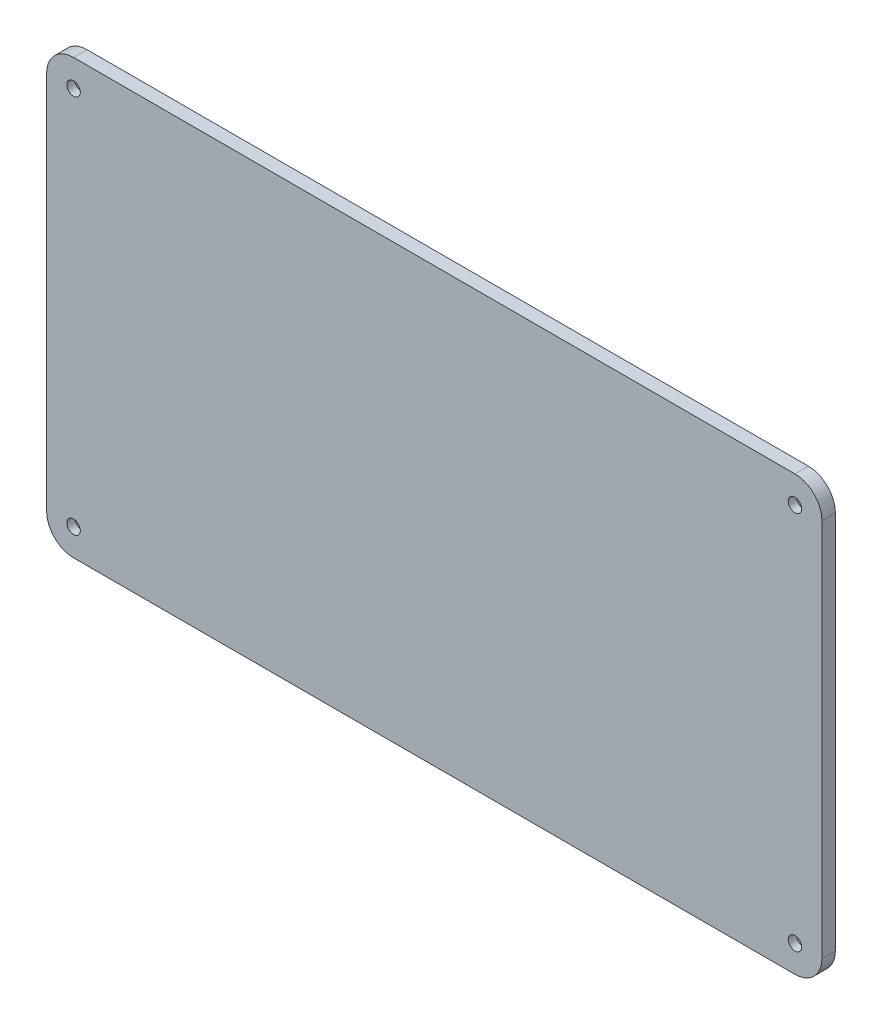
ISO-10303-21;
HEADER;
FILE_DESCRIPTION(('STEP AP214'),'2;1');
FILE_NAME('part.step','',(''),(''),'','','');
FILE_SCHEMA(('AUTOMOTIVE_DESIGN { 1 0 10303 214 1 1 1 1 }'));
ENDSEC;
DATA;
#1=APPLICATION_CONTEXT('core data for automotive mechanical design processes');
#2=APPLICATION_PROTOCOL_DEFINITION('international standard','automotive_design',2000,#1);
#3=PRODUCT_CONTEXT('',#1,'mechanical');
#4=PRODUCT('Part','Part','',(#3));
#5=PRODUCT_RELATED_PRODUCT_CATEGORY('part','',(#4));
#6=PRODUCT_DEFINITION_FORMATION('','',#4);
#7=PRODUCT_DEFINITION_CONTEXT('part definition',#1,'design');
#8=PRODUCT_DEFINITION('design','',#6,#7);
#9=PRODUCT_DEFINITION_SHAPE('','',#8);
#10=(LENGTH_UNIT() NAMED_UNIT(*) SI_UNIT(.MILLI.,.METRE.));
#11=(NAMED_UNIT(*) PLANE_ANGLE_UNIT() SI_UNIT($,.RADIAN.));
#12=(NAMED_UNIT(*) SI_UNIT($,.STERADIAN.) SOLID_ANGLE_UNIT());
#13=UNCERTAINTY_MEASURE_WITH_UNIT(LENGTH_MEASURE(1.E-05),#10,'distance_accuracy_value','');
#14=(GEOMETRIC_REPRESENTATION_CONTEXT(3) GLOBAL_UNCERTAINTY_ASSIGNED_CONTEXT((#13)) GLOBAL_UNIT_ASSIGNED_CONTEXT((#10,
#11,#12)) REPRESENTATION_CONTEXT('',''));
#15=CARTESIAN_POINT('',(0.,0.,0.));
#16=DIRECTION('',(0.,0.,1.));
#17=DIRECTION('',(1.,0.,0.));
#18=AXIS2_PLACEMENT_3D('',#15,#16,#17);
#19=CARTESIAN_POINT('',(10.,151.,0.));
#20=DIRECTION('',(0.,0.,1.));
#21=DIRECTION('',(1.,0.,0.));
#22=AXIS2_PLACEMENT_3D('',#19,#20,#21);
#23=CYLINDRICAL_SURFACE('',#22,0.799999999999999);
#24=CARTESIAN_POINT('',(10.,151.,0.));
#25=DIRECTION('',(0.,0.,1.));
#26=DIRECTION('',(1.,0.,0.));
#27=AXIS2_PLACEMENT_3D('',#24,#25,#26);
#28=CIRCLE('',#27,0.799999999999999);
#29=CARTESIAN_POINT('',(10.8,151.,0.));
#30=VERTEX_POINT('',#29);
#31=EDGE_CURVE('E153',#30,#30,#28,.T.);
#32=ORIENTED_EDGE('',*,*,#31,.F.);
#33=EDGE_LOOP('',(#32));
#34=FACE_BOUND('',#33,.T.);
#35=CARTESIAN_POINT('',(10.,151.,2.));
#36=DIRECTION('',(0.,0.,1.));
#37=DIRECTION('',(1.,0.,0.));
#38=AXIS2_PLACEMENT_3D('',#35,#36,#37);
#39=CIRCLE('',#38,0.799999999999999);
#40=CARTESIAN_POINT('',(10.8,151.,2.));
#41=VERTEX_POINT('',#40);
#42=EDGE_CURVE('E48',#41,#41,#39,.F.);
#43=ORIENTED_EDGE('',*,*,#42,.F.);
#44=EDGE_LOOP('',(#43));
#45=FACE_BOUND('',#44,.T.);
#46=ADVANCED_FACE('F44',(#34,#45),#23,.F.);
#47=CARTESIAN_POINT('',(278.,10.,0.));
#48=DIRECTION('',(0.,0.,1.));
#49=DIRECTION('',(1.,0.,0.));
#50=AXIS2_PLACEMENT_3D('',#47,#48,#49);
#51=CYLINDRICAL_SURFACE('',#50,0.800000000000011);
#52=CARTESIAN_POINT('',(278.,10.,0.));
#53=DIRECTION('',(0.,0.,1.));
#54=DIRECTION('',(1.,0.,0.));
#55=AXIS2_PLACEMENT_3D('',#52,#53,#54);
#56=CIRCLE('',#55,0.800000000000011);
#57=CARTESIAN_POINT('',(278.8,10.,0.));
#58=VERTEX_POINT('',#57);
#59=EDGE_CURVE('E204',#58,#58,#56,.T.);
#60=ORIENTED_EDGE('',*,*,#59,.F.);
#61=EDGE_LOOP('',(#60));
#62=FACE_BOUND('',#61,.T.);
#63=CARTESIAN_POINT('',(278.,10.,2.));
#64=DIRECTION('',(0.,0.,1.));
#65=DIRECTION('',(1.,0.,0.));
#66=AXIS2_PLACEMENT_3D('',#63,#64,#65);
#67=CIRCLE('',#66,0.800000000000011);
#68=CARTESIAN_POINT('',(278.8,10.,2.));
#69=VERTEX_POINT('',#68);
#70=EDGE_CURVE('E197',#69,#69,#67,.F.);
#71=ORIENTED_EDGE('',*,*,#70,.F.);
#72=EDGE_LOOP('',(#71));
#73=FACE_BOUND('',#72,.T.);
#74=ADVANCED_FACE('F266',(#62,#73),#51,.F.);
#75=CARTESIAN_POINT('',(10.,10.,0.));
#76=DIRECTION('',(0.,0.,1.));
#77=DIRECTION('',(1.,0.,0.));
#78=AXIS2_PLACEMENT_3D('',#75,#76,#77);
#79=CYLINDRICAL_SURFACE('',#78,0.800000000000001);
#80=CARTESIAN_POINT('',(10.,10.,0.));
#81=DIRECTION('',(0.,0.,1.));
#82=DIRECTION('',(1.,0.,0.));
#83=AXIS2_PLACEMENT_3D('',#80,#81,#82);
#84=CIRCLE('',#83,0.800000000000001);
#85=CARTESIAN_POINT('',(10.8,10.,0.));
#86=VERTEX_POINT('',#85);
#87=EDGE_CURVE('E209',#86,#86,#84,.T.);
#88=ORIENTED_EDGE('',*,*,#87,.F.);
#89=EDGE_LOOP('',(#88));
#90=FACE_BOUND('',#89,.T.);
#91=CARTESIAN_POINT('',(10.,10.,2.));
#92=DIRECTION('',(0.,0.,1.));
#93=DIRECTION('',(1.,0.,0.));
#94=AXIS2_PLACEMENT_3D('',#91,#92,#93);
#95=CIRCLE('',#94,0.800000000000001);
#96=CARTESIAN_POINT('',(10.8,10.,2.));
#97=VERTEX_POINT('',#96);
#98=EDGE_CURVE('E193',#97,#97,#95,.F.);
#99=ORIENTED_EDGE('',*,*,#98,.F.);
#100=EDGE_LOOP('',(#99));
#101=FACE_BOUND('',#100,.T.);
#102=ADVANCED_FACE('F272',(#90,#101),#79,.F.);
#103=CARTESIAN_POINT('',(278.,151.,0.));
#104=DIRECTION('',(0.,0.,1.));
#105=DIRECTION('',(1.,0.,0.));
#106=AXIS2_PLACEMENT_3D('',#103,#104,#105);
#107=CYLINDRICAL_SURFACE('',#106,0.800000000000008);
#108=CARTESIAN_POINT('',(278.,151.,0.));
#109=DIRECTION('',(0.,0.,1.));
#110=DIRECTION('',(1.,0.,0.));
#111=AXIS2_PLACEMENT_3D('',#108,#109,#110);
#112=CIRCLE('',#111,0.800000000000008);
#113=CARTESIAN_POINT('',(278.8,151.,0.));
#114=VERTEX_POINT('',#113);
#115=EDGE_CURVE('E215',#114,#114,#112,.T.);
#116=ORIENTED_EDGE('',*,*,#115,.F.);
#117=EDGE_LOOP('',(#116));
#118=FACE_BOUND('',#117,.T.);
#119=CARTESIAN_POINT('',(278.,151.,2.));
#120=DIRECTION('',(0.,0.,1.));
#121=DIRECTION('',(1.,0.,0.));
#122=AXIS2_PLACEMENT_3D('',#119,#120,#121);
#123=CIRCLE('',#122,0.800000000000008);
#124=CARTESIAN_POINT('',(278.8,151.,2.));
#125=VERTEX_POINT('',#124);
#126=EDGE_CURVE('E189',#125,#125,#123,.F.);
#127=ORIENTED_EDGE('',*,*,#126,.F.);
#128=EDGE_LOOP('',(#127));
#129=FACE_BOUND('',#128,.T.);
#130=ADVANCED_FACE('F295',(#118,#129),#107,.F.);
#131=CARTESIAN_POINT('',(278.,151.,5.));
#132=DIRECTION('',(0.,0.,-1.));
#133=DIRECTION('',(-1.,0.,0.));
#134=AXIS2_PLACEMENT_3D('',#131,#132,#133);
#135=CYLINDRICAL_SURFACE('',#134,10.);
#136=CARTESIAN_POINT('',(278.,151.,0.));
#137=DIRECTION('',(0.,0.,1.));
#138=DIRECTION('',(-1.,0.,0.));
#139=AXIS2_PLACEMENT_3D('',#136,#137,#138);
#140=CIRCLE('',#139,10.);
#141=CARTESIAN_POINT('',(288.,151.,0.));
#142=VERTEX_POINT('',#141);
#143=CARTESIAN_POINT('',(278.,161.,0.));
#144=VERTEX_POINT('',#143);
#145=EDGE_CURVE('E148',#142,#144,#140,.T.);
#146=ORIENTED_EDGE('',*,*,#145,.T.);
#147=DIRECTION('',(0.,0.,-1.));
#148=VECTOR('',#147,1.);
#149=CARTESIAN_POINT('',(278.,161.,5.));
#150=LINE('',#149,#148);
#151=CARTESIAN_POINT('',(278.,161.,5.));
#152=VERTEX_POINT('',#151);
#153=EDGE_CURVE('E11',#152,#144,#150,.T.);
#154=ORIENTED_EDGE('',*,*,#153,.F.);
#155=CARTESIAN_POINT('',(278.,151.,5.));
#156=DIRECTION('',(0.,0.,1.));
#157=DIRECTION('',(-1.,0.,0.));
#158=AXIS2_PLACEMENT_3D('',#155,#156,#157);
#159=CIRCLE('',#158,10.);
#160=CARTESIAN_POINT('',(288.,151.,5.));
#161=VERTEX_POINT('',#160);
#162=EDGE_CURVE('E171',#161,#152,#159,.T.);
#163=ORIENTED_EDGE('',*,*,#162,.F.);
#164=DIRECTION('',(0.,0.,-1.));
#165=VECTOR('',#164,1.);
#166=CARTESIAN_POINT('',(288.,151.,5.));
#167=LINE('',#166,#165);
#168=EDGE_CURVE('E144',#161,#142,#167,.T.);
#169=ORIENTED_EDGE('',*,*,#168,.T.);
#170=EDGE_LOOP('',(#146,#154,#163,#169));
#171=FACE_BOUND('',#170,.T.);
#172=ADVANCED_FACE('F46',(#171),#135,.T.);
#173=CARTESIAN_POINT('',(10.0000000000001,161.,5.));
#174=DIRECTION('',(0.,-1.,0.));
#175=DIRECTION('',(0.,0.,-1.));
#176=AXIS2_PLACEMENT_3D('',#173,#174,#175);
#177=PLANE('',#176);
#178=DIRECTION('',(-1.,0.,0.));
#179=VECTOR('',#178,1.);
#180=CARTESIAN_POINT('',(10.0000000000001,161.,0.));
#181=LINE('',#180,#179);
#182=CARTESIAN_POINT('',(10.0000000000001,161.,0.));
#183=VERTEX_POINT('',#182);
#184=EDGE_CURVE('E152',#144,#183,#181,.T.);
#185=ORIENTED_EDGE('',*,*,#184,.T.);
#186=DIRECTION('',(0.,0.,-1.));
#187=VECTOR('',#186,1.);
#188=CARTESIAN_POINT('',(10.0000000000001,161.,5.));
#189=LINE('',#188,#187);
#190=CARTESIAN_POINT('',(10.0000000000001,161.,5.));
#191=VERTEX_POINT('',#190);
#192=EDGE_CURVE('E55',#191,#183,#189,.T.);
#193=ORIENTED_EDGE('',*,*,#192,.F.);
#194=DIRECTION('',(-1.,0.,0.));
#195=VECTOR('',#194,1.);
#196=CARTESIAN_POINT('',(10.0000000000001,161.,5.));
#197=LINE('',#196,#195);
#198=EDGE_CURVE('E107',#152,#191,#197,.T.);
#199=ORIENTED_EDGE('',*,*,#198,.F.);
#200=ORIENTED_EDGE('',*,*,#153,.T.);
#201=EDGE_LOOP('',(#185,#193,#199,#200));
#202=FACE_BOUND('',#201,.T.);
#203=ADVANCED_FACE('F333',(#202),#177,.F.);
#204=CARTESIAN_POINT('',(10.,151.,5.));
#205=DIRECTION('',(0.,0.,-1.));
#206=DIRECTION('',(-1.,0.,0.));
#207=AXIS2_PLACEMENT_3D('',#204,#205,#206);
#208=CYLINDRICAL_SURFACE('',#207,10.);
#209=CARTESIAN_POINT('',(10.,151.,0.));
#210=DIRECTION('',(0.,0.,1.));
#211=DIRECTION('',(-1.,0.,0.));
#212=AXIS2_PLACEMENT_3D('',#209,#210,#211);
#213=CIRCLE('',#212,10.);
#214=CARTESIAN_POINT('',(0.,151.,0.));
#215=VERTEX_POINT('',#214);
#216=EDGE_CURVE('E156',#183,#215,#213,.T.);
#217=ORIENTED_EDGE('',*,*,#216,.T.);
#218=DIRECTION('',(0.,0.,-1.));
#219=VECTOR('',#218,1.);
#220=CARTESIAN_POINT('',(0.,151.,5.));
#221=LINE('',#220,#219);
#222=CARTESIAN_POINT('',(0.,151.,5.));
#223=VERTEX_POINT('',#222);
#224=EDGE_CURVE('E182',#223,#215,#221,.T.);
#225=ORIENTED_EDGE('',*,*,#224,.F.);
#226=CARTESIAN_POINT('',(10.,151.,5.));
#227=DIRECTION('',(0.,0.,1.));
#228=DIRECTION('',(-1.,0.,0.));
#229=AXIS2_PLACEMENT_3D('',#226,#227,#228);
#230=CIRCLE('',#229,10.);
#231=EDGE_CURVE('E231',#191,#223,#230,.T.);
#232=ORIENTED_EDGE('',*,*,#231,.F.);
#233=ORIENTED_EDGE('',*,*,#192,.T.);
#234=EDGE_LOOP('',(#217,#225,#232,#233));
#235=FACE_BOUND('',#234,.T.);
#236=ADVANCED_FACE('F340',(#235),#208,.T.);
#237=CARTESIAN_POINT('',(0.,10.0000000000001,5.));
#238=DIRECTION('',(1.,0.,0.));
#239=DIRECTION('',(0.,0.,-1.));
#240=AXIS2_PLACEMENT_3D('',#237,#238,#239);
#241=PLANE('',#240);
#242=DIRECTION('',(0.,-1.,0.));
#243=VECTOR('',#242,1.);
#244=CARTESIAN_POINT('',(0.,10.0000000000001,0.));
#245=LINE('',#244,#243);
#246=CARTESIAN_POINT('',(0.,10.0000000000001,0.));
#247=VERTEX_POINT('',#246);
#248=EDGE_CURVE('E159',#215,#247,#245,.T.);
#249=ORIENTED_EDGE('',*,*,#248,.T.);
#250=DIRECTION('',(0.,0.,-1.));
#251=VECTOR('',#250,1.);
#252=CARTESIAN_POINT('',(0.,10.0000000000001,5.));
#253=LINE('',#252,#251);
#254=CARTESIAN_POINT('',(0.,10.0000000000001,5.));
#255=VERTEX_POINT('',#254);
#256=EDGE_CURVE('E178',#255,#247,#253,.T.);
#257=ORIENTED_EDGE('',*,*,#256,.F.);
#258=DIRECTION('',(0.,-1.,0.));
#259=VECTOR('',#258,1.);
#260=CARTESIAN_POINT('',(0.,10.0000000000001,5.));
#261=LINE('',#260,#259);
#262=EDGE_CURVE('E234',#223,#255,#261,.T.);
#263=ORIENTED_EDGE('',*,*,#262,.F.);
#264=ORIENTED_EDGE('',*,*,#224,.T.);
#265=EDGE_LOOP('',(#249,#257,#263,#264));
#266=FACE_BOUND('',#265,.T.);
#267=ADVANCED_FACE('F242',(#266),#241,.F.);
#268=CARTESIAN_POINT('',(10.,10.,5.));
#269=DIRECTION('',(0.,0.,-1.));
#270=DIRECTION('',(-1.,0.,0.));
#271=AXIS2_PLACEMENT_3D('',#268,#269,#270);
#272=CYLINDRICAL_SURFACE('',#271,10.);
#273=CARTESIAN_POINT('',(10.,10.,0.));
#274=DIRECTION('',(0.,0.,1.));
#275=DIRECTION('',(-1.,0.,0.));
#276=AXIS2_PLACEMENT_3D('',#273,#274,#275);
#277=CIRCLE('',#276,10.);
#278=CARTESIAN_POINT('',(10.0000000000001,0.,0.));
#279=VERTEX_POINT('',#278);
#280=EDGE_CURVE('E162',#247,#279,#277,.T.);
#281=ORIENTED_EDGE('',*,*,#280,.T.);
#282=DIRECTION('',(0.,0.,-1.));
#283=VECTOR('',#282,1.);
#284=CARTESIAN_POINT('',(10.0000000000001,0.,5.));
#285=LINE('',#284,#283);
#286=CARTESIAN_POINT('',(10.0000000000001,0.,5.));
#287=VERTEX_POINT('',#286);
#288=EDGE_CURVE('E137',#287,#279,#285,.T.);
#289=ORIENTED_EDGE('',*,*,#288,.F.);
#290=CARTESIAN_POINT('',(10.,10.,5.));
#291=DIRECTION('',(0.,0.,1.));
#292=DIRECTION('',(-1.,0.,0.));
#293=AXIS2_PLACEMENT_3D('',#290,#291,#292);
#294=CIRCLE('',#293,10.);
#295=EDGE_CURVE('E126',#255,#287,#294,.T.);
#296=ORIENTED_EDGE('',*,*,#295,.F.);
#297=ORIENTED_EDGE('',*,*,#256,.T.);
#298=EDGE_LOOP('',(#281,#289,#296,#297));
#299=FACE_BOUND('',#298,.T.);
#300=ADVANCED_FACE('F246',(#299),#272,.T.);
#301=CARTESIAN_POINT('',(10.0000000000001,0.,5.));
#302=DIRECTION('',(0.,1.,0.));
#303=DIRECTION('',(0.,0.,1.));
#304=AXIS2_PLACEMENT_3D('',#301,#302,#303);
#305=PLANE('',#304);
#306=DIRECTION('',(1.,0.,0.));
#307=VECTOR('',#306,1.);
#308=CARTESIAN_POINT('',(10.0000000000001,0.,0.));
#309=LINE('',#308,#307);
#310=CARTESIAN_POINT('',(278.,0.,0.));
#311=VERTEX_POINT('',#310);
#312=EDGE_CURVE('E135',#279,#311,#309,.T.);
#313=ORIENTED_EDGE('',*,*,#312,.T.);
#314=DIRECTION('',(0.,0.,-1.));
#315=VECTOR('',#314,1.);
#316=CARTESIAN_POINT('',(278.,0.,5.));
#317=LINE('',#316,#315);
#318=CARTESIAN_POINT('',(278.,0.,5.));
#319=VERTEX_POINT('',#318);
#320=EDGE_CURVE('E132',#319,#311,#317,.T.);
#321=ORIENTED_EDGE('',*,*,#320,.F.);
#322=DIRECTION('',(1.,0.,0.));
#323=VECTOR('',#322,1.);
#324=CARTESIAN_POINT('',(10.0000000000001,0.,5.));
#325=LINE('',#324,#323);
#326=EDGE_CURVE('E120',#287,#319,#325,.T.);
#327=ORIENTED_EDGE('',*,*,#326,.F.);
#328=ORIENTED_EDGE('',*,*,#288,.T.);
#329=EDGE_LOOP('',(#313,#321,#327,#328));
#330=FACE_BOUND('',#329,.T.);
#331=ADVANCED_FACE('F133',(#330),#305,.F.);
#332=CARTESIAN_POINT('',(278.,10.,5.));
#333=DIRECTION('',(0.,0.,-1.));
#334=DIRECTION('',(-1.,0.,0.));
#335=AXIS2_PLACEMENT_3D('',#332,#333,#334);
#336=CYLINDRICAL_SURFACE('',#335,10.);
#337=CARTESIAN_POINT('',(278.,10.,0.));
#338=DIRECTION('',(0.,0.,1.));
#339=DIRECTION('',(1.,0.,0.));
#340=AXIS2_PLACEMENT_3D('',#337,#338,#339);
#341=CIRCLE('',#340,10.);
#342=CARTESIAN_POINT('',(288.,10.,0.));
#343=VERTEX_POINT('',#342);
#344=EDGE_CURVE('E93',#311,#343,#341,.T.);
#345=ORIENTED_EDGE('',*,*,#344,.T.);
#346=DIRECTION('',(0.,0.,-1.));
#347=VECTOR('',#346,1.);
#348=CARTESIAN_POINT('',(288.,10.,5.));
#349=LINE('',#348,#347);
#350=CARTESIAN_POINT('',(288.,10.,5.));
#351=VERTEX_POINT('',#350);
#352=EDGE_CURVE('E138',#351,#343,#349,.T.);
#353=ORIENTED_EDGE('',*,*,#352,.F.);
#354=CARTESIAN_POINT('',(278.,10.,5.));
#355=DIRECTION('',(0.,0.,1.));
#356=DIRECTION('',(1.,0.,0.));
#357=AXIS2_PLACEMENT_3D('',#354,#355,#356);
#358=CIRCLE('',#357,10.);
#359=EDGE_CURVE('E124',#319,#351,#358,.T.);
#360=ORIENTED_EDGE('',*,*,#359,.F.);
#361=ORIENTED_EDGE('',*,*,#320,.T.);
#362=EDGE_LOOP('',(#345,#353,#360,#361));
#363=FACE_BOUND('',#362,.T.);
#364=ADVANCED_FACE('F140',(#363),#336,.T.);
#365=CARTESIAN_POINT('',(288.,10.0000000000001,5.));
#366=DIRECTION('',(-1.,0.,0.));
#367=DIRECTION('',(0.,0.,1.));
#368=AXIS2_PLACEMENT_3D('',#365,#366,#367);
#369=PLANE('',#368);
#370=DIRECTION('',(0.,1.,0.));
#371=VECTOR('',#370,1.);
#372=CARTESIAN_POINT('',(288.,10.0000000000001,0.));
#373=LINE('',#372,#371);
#374=EDGE_CURVE('E99',#343,#142,#373,.T.);
#375=ORIENTED_EDGE('',*,*,#374,.T.);
#376=ORIENTED_EDGE('',*,*,#168,.F.);
#377=DIRECTION('',(0.,1.,0.));
#378=VECTOR('',#377,1.);
#379=CARTESIAN_POINT('',(288.,10.0000000000001,5.));
#380=LINE('',#379,#378);
#381=EDGE_CURVE('E64',#351,#161,#380,.T.);
#382=ORIENTED_EDGE('',*,*,#381,.F.);
#383=ORIENTED_EDGE('',*,*,#352,.T.);
#384=EDGE_LOOP('',(#375,#376,#382,#383));
#385=FACE_BOUND('',#384,.T.);
#386=ADVANCED_FACE('F254',(#385),#369,.F.);
#387=CARTESIAN_POINT('',(278.,151.,5.));
#388=DIRECTION('',(0.,0.,-1.));
#389=DIRECTION('',(-1.,0.,0.));
#390=AXIS2_PLACEMENT_3D('',#387,#388,#389);
#391=PLANE('',#390);
#392=CARTESIAN_POINT('',(278.,151.,5.));
#393=DIRECTION('',(0.,0.,1.));
#394=DIRECTION('',(1.,0.,0.));
#395=AXIS2_PLACEMENT_3D('',#392,#393,#394);
#396=CIRCLE('',#395,2.50000000000002);
#397=CARTESIAN_POINT('',(280.5,151.,5.));
#398=VERTEX_POINT('',#397);
#399=EDGE_CURVE('E542',#398,#398,#396,.T.);
#400=ORIENTED_EDGE('',*,*,#399,.F.);
#401=EDGE_LOOP('',(#400));
#402=FACE_BOUND('',#401,.T.);
#403=CARTESIAN_POINT('',(278.,10.,5.));
#404=DIRECTION('',(0.,0.,1.));
#405=DIRECTION('',(1.,0.,0.));
#406=AXIS2_PLACEMENT_3D('',#403,#404,#405);
#407=CIRCLE('',#406,2.50000000000002);
#408=CARTESIAN_POINT('',(280.5,10.,5.));
#409=VERTEX_POINT('',#408);
#410=EDGE_CURVE('E532',#409,#409,#407,.T.);
#411=ORIENTED_EDGE('',*,*,#410,.F.);
#412=EDGE_LOOP('',(#411));
#413=FACE_BOUND('',#412,.T.);
#414=CARTESIAN_POINT('',(10.,10.,5.));
#415=DIRECTION('',(0.,0.,1.));
#416=DIRECTION('',(1.,0.,0.));
#417=AXIS2_PLACEMENT_3D('',#414,#415,#416);
#418=CIRCLE('',#417,2.5);
#419=CARTESIAN_POINT('',(12.5,10.,5.));
#420=VERTEX_POINT('',#419);
#421=EDGE_CURVE('E523',#420,#420,#418,.T.);
#422=ORIENTED_EDGE('',*,*,#421,.F.);
#423=EDGE_LOOP('',(#422));
#424=FACE_BOUND('',#423,.T.);
#425=CARTESIAN_POINT('',(10.,151.,5.));
#426=DIRECTION('',(0.,0.,1.));
#427=DIRECTION('',(1.,0.,0.));
#428=AXIS2_PLACEMENT_3D('',#425,#426,#427);
#429=CIRCLE('',#428,2.5);
#430=CARTESIAN_POINT('',(12.5,151.,5.));
#431=VERTEX_POINT('',#430);
#432=EDGE_CURVE('E219',#431,#431,#429,.T.);
#433=ORIENTED_EDGE('',*,*,#432,.F.);
#434=EDGE_LOOP('',(#433));
#435=FACE_BOUND('',#434,.T.);
#436=ORIENTED_EDGE('',*,*,#162,.T.);
#437=ORIENTED_EDGE('',*,*,#198,.T.);
#438=ORIENTED_EDGE('',*,*,#231,.T.);
#439=ORIENTED_EDGE('',*,*,#262,.T.);
#440=ORIENTED_EDGE('',*,*,#295,.T.);
#441=ORIENTED_EDGE('',*,*,#326,.T.);
#442=ORIENTED_EDGE('',*,*,#359,.T.);
#443=ORIENTED_EDGE('',*,*,#381,.T.);
#444=EDGE_LOOP('',(#436,#437,#438,#439,#440,#441,#442,#443));
#445=FACE_BOUND('',#444,.T.);
#446=ADVANCED_FACE('F122',(#402,#413,#424,#435,#445),#391,.F.);
#447=CARTESIAN_POINT('',(278.,151.,0.));
#448=DIRECTION('',(0.,0.,-1.));
#449=DIRECTION('',(-1.,0.,0.));
#450=AXIS2_PLACEMENT_3D('',#447,#448,#449);
#451=PLANE('',#450);
#452=ORIENTED_EDGE('',*,*,#115,.T.);
#453=EDGE_LOOP('',(#452));
#454=FACE_BOUND('',#453,.T.);
#455=ORIENTED_EDGE('',*,*,#87,.T.);
#456=EDGE_LOOP('',(#455));
#457=FACE_BOUND('',#456,.T.);
#458=ORIENTED_EDGE('',*,*,#59,.T.);
#459=EDGE_LOOP('',(#458));
#460=FACE_BOUND('',#459,.T.);
#461=ORIENTED_EDGE('',*,*,#31,.T.);
#462=EDGE_LOOP('',(#461));
#463=FACE_BOUND('',#462,.T.);
#464=ORIENTED_EDGE('',*,*,#145,.F.);
#465=ORIENTED_EDGE('',*,*,#374,.F.);
#466=ORIENTED_EDGE('',*,*,#344,.F.);
#467=ORIENTED_EDGE('',*,*,#312,.F.);
#468=ORIENTED_EDGE('',*,*,#280,.F.);
#469=ORIENTED_EDGE('',*,*,#248,.F.);
#470=ORIENTED_EDGE('',*,*,#216,.F.);
#471=ORIENTED_EDGE('',*,*,#184,.F.);
#472=EDGE_LOOP('',(#464,#465,#466,#467,#468,#469,#470,#471));
#473=FACE_BOUND('',#472,.T.);
#474=ADVANCED_FACE('F249',(#454,#457,#460,#463,#473),#451,.T.);
#475=CARTESIAN_POINT('',(278.,151.,2.));
#476=DIRECTION('',(0.,0.,1.));
#477=DIRECTION('',(1.,0.,0.));
#478=AXIS2_PLACEMENT_3D('',#475,#476,#477);
#479=PLANE('',#478);
#480=CARTESIAN_POINT('',(278.,151.,2.));
#481=DIRECTION('',(0.,0.,1.));
#482=DIRECTION('',(1.,0.,0.));
#483=AXIS2_PLACEMENT_3D('',#480,#481,#482);
#484=CIRCLE('',#483,2.50000000000002);
#485=CARTESIAN_POINT('',(280.5,151.,2.));
#486=VERTEX_POINT('',#485);
#487=EDGE_CURVE('E546',#486,#486,#484,.T.);
#488=ORIENTED_EDGE('',*,*,#487,.T.);
#489=EDGE_LOOP('',(#488));
#490=FACE_BOUND('',#489,.T.);
#491=ORIENTED_EDGE('',*,*,#126,.T.);
#492=EDGE_LOOP('',(#491));
#493=FACE_BOUND('',#492,.T.);
#494=ADVANCED_FACE('F280',(#490,#493),#479,.T.);
#495=CARTESIAN_POINT('',(278.,151.,2.));
#496=DIRECTION('',(0.,0.,1.));
#497=DIRECTION('',(1.,0.,0.));
#498=AXIS2_PLACEMENT_3D('',#495,#496,#497);
#499=CYLINDRICAL_SURFACE('',#498,2.50000000000002);
#500=ORIENTED_EDGE('',*,*,#487,.F.);
#501=EDGE_LOOP('',(#500));
#502=FACE_BOUND('',#501,.T.);
#503=ORIENTED_EDGE('',*,*,#399,.T.);
#504=EDGE_LOOP('',(#503));
#505=FACE_BOUND('',#504,.T.);
#506=ADVANCED_FACE('F285',(#502,#505),#499,.F.);
#507=CARTESIAN_POINT('',(10.,10.,2.));
#508=DIRECTION('',(0.,0.,1.));
#509=DIRECTION('',(1.,0.,0.));
#510=AXIS2_PLACEMENT_3D('',#507,#508,#509);
#511=PLANE('',#510);
#512=CARTESIAN_POINT('',(10.,10.,2.));
#513=DIRECTION('',(0.,0.,1.));
#514=DIRECTION('',(1.,0.,0.));
#515=AXIS2_PLACEMENT_3D('',#512,#513,#514);
#516=CIRCLE('',#515,2.5);
#517=CARTESIAN_POINT('',(12.5,10.,2.));
#518=VERTEX_POINT('',#517);
#519=EDGE_CURVE('E527',#518,#518,#516,.T.);
#520=ORIENTED_EDGE('',*,*,#519,.T.);
#521=EDGE_LOOP('',(#520));
#522=FACE_BOUND('',#521,.T.);
#523=ORIENTED_EDGE('',*,*,#98,.T.);
#524=EDGE_LOOP('',(#523));
#525=FACE_BOUND('',#524,.T.);
#526=ADVANCED_FACE('F298',(#522,#525),#511,.T.);
#527=CARTESIAN_POINT('',(10.,10.,2.));
#528=DIRECTION('',(0.,0.,1.));
#529=DIRECTION('',(1.,0.,0.));
#530=AXIS2_PLACEMENT_3D('',#527,#528,#529);
#531=CYLINDRICAL_SURFACE('',#530,2.5);
#532=ORIENTED_EDGE('',*,*,#519,.F.);
#533=EDGE_LOOP('',(#532));
#534=FACE_BOUND('',#533,.T.);
#535=ORIENTED_EDGE('',*,*,#421,.T.);
#536=EDGE_LOOP('',(#535));
#537=FACE_BOUND('',#536,.T.);
#538=ADVANCED_FACE('F300',(#534,#537),#531,.F.);
#539=CARTESIAN_POINT('',(278.,10.,2.));
#540=DIRECTION('',(0.,0.,1.));
#541=DIRECTION('',(1.,0.,0.));
#542=AXIS2_PLACEMENT_3D('',#539,#540,#541);
#543=PLANE('',#542);
#544=CARTESIAN_POINT('',(278.,10.,2.));
#545=DIRECTION('',(0.,0.,1.));
#546=DIRECTION('',(1.,0.,0.));
#547=AXIS2_PLACEMENT_3D('',#544,#545,#546);
#548=CIRCLE('',#547,2.50000000000002);
#549=CARTESIAN_POINT('',(280.5,10.,2.));
#550=VERTEX_POINT('',#549);
#551=EDGE_CURVE('E538',#550,#550,#548,.T.);
#552=ORIENTED_EDGE('',*,*,#551,.T.);
#553=EDGE_LOOP('',(#552));
#554=FACE_BOUND('',#553,.T.);
#555=ORIENTED_EDGE('',*,*,#70,.T.);
#556=EDGE_LOOP('',(#555));
#557=FACE_BOUND('',#556,.T.);
#558=ADVANCED_FACE('F307',(#554,#557),#543,.T.);
#559=CARTESIAN_POINT('',(278.,10.,2.));
#560=DIRECTION('',(0.,0.,1.));
#561=DIRECTION('',(1.,0.,0.));
#562=AXIS2_PLACEMENT_3D('',#559,#560,#561);
#563=CYLINDRICAL_SURFACE('',#562,2.50000000000002);
#564=ORIENTED_EDGE('',*,*,#551,.F.);
#565=EDGE_LOOP('',(#564));
#566=FACE_BOUND('',#565,.T.);
#567=ORIENTED_EDGE('',*,*,#410,.T.);
#568=EDGE_LOOP('',(#567));
#569=FACE_BOUND('',#568,.T.);
#570=ADVANCED_FACE('F314',(#566,#569),#563,.F.);
#571=CARTESIAN_POINT('',(10.,151.,2.));
#572=DIRECTION('',(0.,0.,1.));
#573=DIRECTION('',(1.,0.,0.));
#574=AXIS2_PLACEMENT_3D('',#571,#572,#573);
#575=PLANE('',#574);
#576=CARTESIAN_POINT('',(10.,151.,2.));
#577=DIRECTION('',(0.,0.,1.));
#578=DIRECTION('',(1.,0.,0.));
#579=AXIS2_PLACEMENT_3D('',#576,#577,#578);
#580=CIRCLE('',#579,2.5);
#581=CARTESIAN_POINT('',(12.5,151.,2.));
#582=VERTEX_POINT('',#581);
#583=EDGE_CURVE('E194',#582,#582,#580,.T.);
#584=ORIENTED_EDGE('',*,*,#583,.T.);
#585=EDGE_LOOP('',(#584));
#586=FACE_BOUND('',#585,.T.);
#587=ORIENTED_EDGE('',*,*,#42,.T.);
#588=EDGE_LOOP('',(#587));
#589=FACE_BOUND('',#588,.T.);
#590=ADVANCED_FACE('F317',(#586,#589),#575,.T.);
#591=CARTESIAN_POINT('',(10.,151.,2.));
#592=DIRECTION('',(0.,0.,1.));
#593=DIRECTION('',(1.,0.,0.));
#594=AXIS2_PLACEMENT_3D('',#591,#592,#593);
#595=CYLINDRICAL_SURFACE('',#594,2.5);
#596=ORIENTED_EDGE('',*,*,#583,.F.);
#597=EDGE_LOOP('',(#596));
#598=FACE_BOUND('',#597,.T.);
#599=ORIENTED_EDGE('',*,*,#432,.T.);
#600=EDGE_LOOP('',(#599));
#601=FACE_BOUND('',#600,.T.);
#602=ADVANCED_FACE('F324',(#598,#601),#595,.F.);
#603=CLOSED_SHELL('',(#46,#74,#102,#130,#172,#203,#236,#267,#300,#331,#364,#386,#446,#474,#494,
#506,#526,#538,#558,#570,#590,#602));
#604=MANIFOLD_SOLID_BREP('B2',#603);
#605=ADVANCED_BREP_SHAPE_REPRESENTATION('',(#18,#604),#14);
#606=SHAPE_DEFINITION_REPRESENTATION(#9,#605);
ENDSEC;
END-ISO-10303-21;
